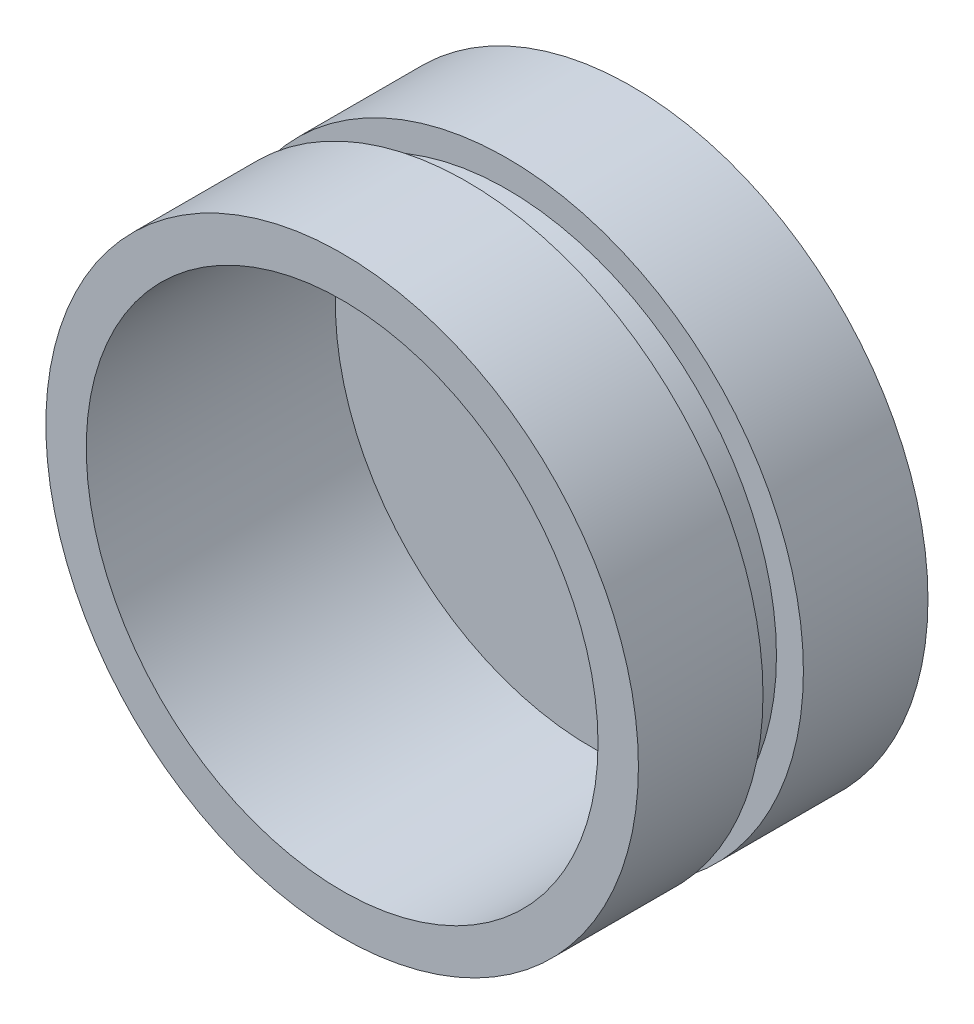
ISO-10303-21;
HEADER;
FILE_DESCRIPTION(('STEP AP214'),'2;1');
FILE_NAME('part.step','',(''),(''),'','','');
FILE_SCHEMA(('AUTOMOTIVE_DESIGN { 1 0 10303 214 1 1 1 1 }'));
ENDSEC;
DATA;
#1=APPLICATION_CONTEXT('core data for automotive mechanical design processes');
#2=APPLICATION_PROTOCOL_DEFINITION('international standard','automotive_design',2000,#1);
#3=PRODUCT_CONTEXT('',#1,'mechanical');
#4=PRODUCT('Part','Part','',(#3));
#5=PRODUCT_RELATED_PRODUCT_CATEGORY('part','',(#4));
#6=PRODUCT_DEFINITION_FORMATION('','',#4);
#7=PRODUCT_DEFINITION_CONTEXT('part definition',#1,'design');
#8=PRODUCT_DEFINITION('design','',#6,#7);
#9=PRODUCT_DEFINITION_SHAPE('','',#8);
#10=(LENGTH_UNIT() NAMED_UNIT(*) SI_UNIT(.MILLI.,.METRE.));
#11=(NAMED_UNIT(*) PLANE_ANGLE_UNIT() SI_UNIT($,.RADIAN.));
#12=(NAMED_UNIT(*) SI_UNIT($,.STERADIAN.) SOLID_ANGLE_UNIT());
#13=UNCERTAINTY_MEASURE_WITH_UNIT(LENGTH_MEASURE(1.E-05),#10,'distance_accuracy_value','');
#14=(GEOMETRIC_REPRESENTATION_CONTEXT(3) GLOBAL_UNCERTAINTY_ASSIGNED_CONTEXT((#13)) GLOBAL_UNIT_ASSIGNED_CONTEXT((#10,
#11,#12)) REPRESENTATION_CONTEXT('',''));
#15=CARTESIAN_POINT('',(0.,0.,0.));
#16=DIRECTION('',(0.,0.,1.));
#17=DIRECTION('',(1.,0.,0.));
#18=AXIS2_PLACEMENT_3D('',#15,#16,#17);
#19=CARTESIAN_POINT('',(0.,0.,21.5));
#20=DIRECTION('',(0.,0.,-1.));
#21=DIRECTION('',(-1.,0.,0.));
#22=AXIS2_PLACEMENT_3D('',#19,#20,#21);
#23=CYLINDRICAL_SURFACE('',#22,22.);
#24=CARTESIAN_POINT('',(0.,0.,0.));
#25=DIRECTION('',(0.,0.,1.));
#26=DIRECTION('',(1.,0.,0.));
#27=AXIS2_PLACEMENT_3D('',#24,#25,#26);
#28=CIRCLE('',#27,22.);
#29=CARTESIAN_POINT('',(22.,0.,0.));
#30=VERTEX_POINT('',#29);
#31=EDGE_CURVE('E48',#30,#30,#28,.T.);
#32=ORIENTED_EDGE('',*,*,#31,.T.);
#33=EDGE_LOOP('',(#32));
#34=FACE_BOUND('',#33,.T.);
#35=CARTESIAN_POINT('',(0.,0.,9.25));
#36=DIRECTION('',(0.,0.,1.));
#37=DIRECTION('',(1.,0.,0.));
#38=AXIS2_PLACEMENT_3D('',#35,#36,#37);
#39=CIRCLE('',#38,22.);
#40=CARTESIAN_POINT('',(22.,0.,9.25));
#41=VERTEX_POINT('',#40);
#42=EDGE_CURVE('E67',#41,#41,#39,.T.);
#43=ORIENTED_EDGE('',*,*,#42,.F.);
#44=EDGE_LOOP('',(#43));
#45=FACE_BOUND('',#44,.T.);
#46=ADVANCED_FACE('F39',(#34,#45),#23,.T.);
#47=CARTESIAN_POINT('',(0.,0.,21.5));
#48=DIRECTION('',(0.,0.,-1.));
#49=DIRECTION('',(-1.,0.,0.));
#50=AXIS2_PLACEMENT_3D('',#47,#48,#49);
#51=CYLINDRICAL_SURFACE('',#50,2.);
#52=CARTESIAN_POINT('',(0.,0.,0.));
#53=DIRECTION('',(0.,0.,1.));
#54=DIRECTION('',(1.,0.,0.));
#55=AXIS2_PLACEMENT_3D('',#52,#53,#54);
#56=CIRCLE('',#55,2.);
#57=CARTESIAN_POINT('',(2.,0.,0.));
#58=VERTEX_POINT('',#57);
#59=EDGE_CURVE('E54',#58,#58,#56,.T.);
#60=ORIENTED_EDGE('',*,*,#59,.F.);
#61=EDGE_LOOP('',(#60));
#62=FACE_BOUND('',#61,.T.);
#63=CARTESIAN_POINT('',(0.,0.,3.));
#64=DIRECTION('',(0.,0.,1.));
#65=DIRECTION('',(1.,0.,0.));
#66=AXIS2_PLACEMENT_3D('',#63,#64,#65);
#67=CIRCLE('',#66,2.);
#68=CARTESIAN_POINT('',(2.,0.,3.));
#69=VERTEX_POINT('',#68);
#70=EDGE_CURVE('E43',#69,#69,#67,.T.);
#71=ORIENTED_EDGE('',*,*,#70,.T.);
#72=EDGE_LOOP('',(#71));
#73=FACE_BOUND('',#72,.T.);
#74=ADVANCED_FACE('F96',(#62,#73),#51,.F.);
#75=CARTESIAN_POINT('',(0.,0.,21.5));
#76=DIRECTION('',(0.,0.,1.));
#77=DIRECTION('',(1.,0.,0.));
#78=AXIS2_PLACEMENT_3D('',#75,#76,#77);
#79=PLANE('',#78);
#80=CARTESIAN_POINT('',(0.,0.,21.5));
#81=DIRECTION('',(0.,0.,1.));
#82=DIRECTION('',(1.,0.,0.));
#83=AXIS2_PLACEMENT_3D('',#80,#81,#82);
#84=CIRCLE('',#83,19.);
#85=CARTESIAN_POINT('',(19.,0.,21.5));
#86=VERTEX_POINT('',#85);
#87=EDGE_CURVE('E63',#86,#86,#84,.T.);
#88=ORIENTED_EDGE('',*,*,#87,.F.);
#89=EDGE_LOOP('',(#88));
#90=FACE_BOUND('',#89,.T.);
#91=CARTESIAN_POINT('',(0.,0.,21.5));
#92=DIRECTION('',(0.,0.,1.));
#93=DIRECTION('',(1.,0.,0.));
#94=AXIS2_PLACEMENT_3D('',#91,#92,#93);
#95=CIRCLE('',#94,22.);
#96=CARTESIAN_POINT('',(22.,0.,21.5));
#97=VERTEX_POINT('',#96);
#98=EDGE_CURVE('E11',#97,#97,#95,.T.);
#99=ORIENTED_EDGE('',*,*,#98,.T.);
#100=EDGE_LOOP('',(#99));
#101=FACE_BOUND('',#100,.T.);
#102=ADVANCED_FACE('F101',(#90,#101),#79,.T.);
#103=CARTESIAN_POINT('',(0.,0.,0.));
#104=DIRECTION('',(0.,0.,1.));
#105=DIRECTION('',(1.,0.,0.));
#106=AXIS2_PLACEMENT_3D('',#103,#104,#105);
#107=PLANE('',#106);
#108=ORIENTED_EDGE('',*,*,#31,.F.);
#109=EDGE_LOOP('',(#108));
#110=FACE_BOUND('',#109,.T.);
#111=ORIENTED_EDGE('',*,*,#59,.T.);
#112=EDGE_LOOP('',(#111));
#113=FACE_BOUND('',#112,.T.);
#114=ADVANCED_FACE('F106',(#110,#113),#107,.F.);
#115=CARTESIAN_POINT('',(0.,0.,12.25));
#116=DIRECTION('',(0.,0.,1.));
#117=DIRECTION('',(1.,0.,0.));
#118=AXIS2_PLACEMENT_3D('',#115,#116,#117);
#119=CIRCLE('',#118,22.);
#120=CARTESIAN_POINT('',(22.,0.,12.25));
#121=VERTEX_POINT('',#120);
#122=EDGE_CURVE('E68',#121,#121,#119,.T.);
#123=ORIENTED_EDGE('',*,*,#122,.T.);
#124=EDGE_LOOP('',(#123));
#125=FACE_BOUND('',#124,.T.);
#126=ORIENTED_EDGE('',*,*,#98,.F.);
#127=EDGE_LOOP('',(#126));
#128=FACE_BOUND('',#127,.T.);
#129=ADVANCED_FACE('F41',(#125,#128),#23,.T.);
#130=CARTESIAN_POINT('',(0.,0.,-53.7401153701776));
#131=DIRECTION('',(0.,0.,1.));
#132=DIRECTION('',(1.,0.,0.));
#133=AXIS2_PLACEMENT_3D('',#130,#131,#132);
#134=CYLINDRICAL_SURFACE('',#133,19.);
#135=CARTESIAN_POINT('',(0.,0.,3.));
#136=DIRECTION('',(0.,0.,1.));
#137=DIRECTION('',(1.,0.,0.));
#138=AXIS2_PLACEMENT_3D('',#135,#136,#137);
#139=CIRCLE('',#138,19.);
#140=CARTESIAN_POINT('',(19.,0.,3.));
#141=VERTEX_POINT('',#140);
#142=EDGE_CURVE('E59',#141,#141,#139,.F.);
#143=ORIENTED_EDGE('',*,*,#142,.T.);
#144=EDGE_LOOP('',(#143));
#145=FACE_BOUND('',#144,.T.);
#146=ORIENTED_EDGE('',*,*,#87,.T.);
#147=EDGE_LOOP('',(#146));
#148=FACE_BOUND('',#147,.T.);
#149=ADVANCED_FACE('F105',(#145,#148),#134,.F.);
#150=CARTESIAN_POINT('',(0.,0.,3.));
#151=DIRECTION('',(0.,0.,1.));
#152=DIRECTION('',(1.,0.,0.));
#153=AXIS2_PLACEMENT_3D('',#150,#151,#152);
#154=PLANE('',#153);
#155=ORIENTED_EDGE('',*,*,#70,.F.);
#156=EDGE_LOOP('',(#155));
#157=FACE_BOUND('',#156,.T.);
#158=ORIENTED_EDGE('',*,*,#142,.F.);
#159=EDGE_LOOP('',(#158));
#160=FACE_BOUND('',#159,.T.);
#161=ADVANCED_FACE('F91',(#157,#160),#154,.T.);
#162=CARTESIAN_POINT('',(0.,0.,9.25));
#163=DIRECTION('',(0.,0.,1.));
#164=DIRECTION('',(1.,0.,0.));
#165=AXIS2_PLACEMENT_3D('',#162,#163,#164);
#166=PLANE('',#165);
#167=CARTESIAN_POINT('',(0.,0.,9.25));
#168=DIRECTION('',(0.,0.,1.));
#169=DIRECTION('',(1.,0.,0.));
#170=AXIS2_PLACEMENT_3D('',#167,#168,#169);
#171=CIRCLE('',#170,20.);
#172=CARTESIAN_POINT('',(20.,0.,9.25));
#173=VERTEX_POINT('',#172);
#174=EDGE_CURVE('E72',#173,#173,#171,.T.);
#175=ORIENTED_EDGE('',*,*,#174,.F.);
#176=EDGE_LOOP('',(#175));
#177=FACE_BOUND('',#176,.T.);
#178=ORIENTED_EDGE('',*,*,#42,.T.);
#179=EDGE_LOOP('',(#178));
#180=FACE_BOUND('',#179,.T.);
#181=ADVANCED_FACE('F87',(#177,#180),#166,.T.);
#182=CARTESIAN_POINT('',(0.,0.,12.25));
#183=DIRECTION('',(0.,0.,1.));
#184=DIRECTION('',(1.,0.,0.));
#185=AXIS2_PLACEMENT_3D('',#182,#183,#184);
#186=PLANE('',#185);
#187=CARTESIAN_POINT('',(0.,0.,12.25));
#188=DIRECTION('',(0.,0.,1.));
#189=DIRECTION('',(1.,0.,0.));
#190=AXIS2_PLACEMENT_3D('',#187,#188,#189);
#191=CIRCLE('',#190,20.);
#192=CARTESIAN_POINT('',(20.,0.,12.25));
#193=VERTEX_POINT('',#192);
#194=EDGE_CURVE('E76',#193,#193,#191,.T.);
#195=ORIENTED_EDGE('',*,*,#194,.T.);
#196=EDGE_LOOP('',(#195));
#197=FACE_BOUND('',#196,.T.);
#198=ORIENTED_EDGE('',*,*,#122,.F.);
#199=EDGE_LOOP('',(#198));
#200=FACE_BOUND('',#199,.T.);
#201=ADVANCED_FACE('F90',(#197,#200),#186,.F.);
#202=CARTESIAN_POINT('',(0.,0.,9.25));
#203=DIRECTION('',(0.,0.,1.));
#204=DIRECTION('',(1.,0.,0.));
#205=AXIS2_PLACEMENT_3D('',#202,#203,#204);
#206=CYLINDRICAL_SURFACE('',#205,20.);
#207=ORIENTED_EDGE('',*,*,#174,.T.);
#208=EDGE_LOOP('',(#207));
#209=FACE_BOUND('',#208,.T.);
#210=ORIENTED_EDGE('',*,*,#194,.F.);
#211=EDGE_LOOP('',(#210));
#212=FACE_BOUND('',#211,.T.);
#213=ADVANCED_FACE('F84',(#209,#212),#206,.T.);
#214=CLOSED_SHELL('',(#46,#74,#102,#114,#129,#149,#161,#181,#201,#213));
#215=MANIFOLD_SOLID_BREP('B2',#214);
#216=ADVANCED_BREP_SHAPE_REPRESENTATION('',(#18,#215),#14);
#217=SHAPE_DEFINITION_REPRESENTATION(#9,#216);
ENDSEC;
END-ISO-10303-21;
